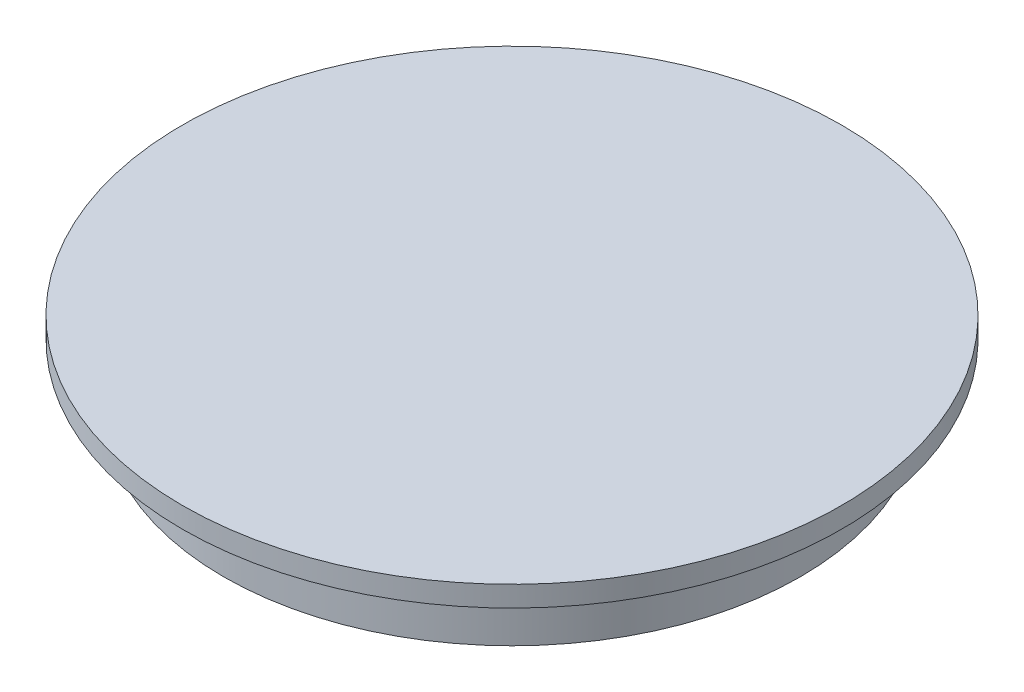
ISO-10303-21;
HEADER;
FILE_DESCRIPTION(('STEP AP214'),'2;1');
FILE_NAME('part.step','',(''),(''),'','','');
FILE_SCHEMA(('AUTOMOTIVE_DESIGN { 1 0 10303 214 1 1 1 1 }'));
ENDSEC;
DATA;
#1=APPLICATION_CONTEXT('core data for automotive mechanical design processes');
#2=APPLICATION_PROTOCOL_DEFINITION('international standard','automotive_design',2000,#1);
#3=PRODUCT_CONTEXT('',#1,'mechanical');
#4=PRODUCT('Part','Part','',(#3));
#5=PRODUCT_RELATED_PRODUCT_CATEGORY('part','',(#4));
#6=PRODUCT_DEFINITION_FORMATION('','',#4);
#7=PRODUCT_DEFINITION_CONTEXT('part definition',#1,'design');
#8=PRODUCT_DEFINITION('design','',#6,#7);
#9=PRODUCT_DEFINITION_SHAPE('','',#8);
#10=(LENGTH_UNIT() NAMED_UNIT(*) SI_UNIT(.MILLI.,.METRE.));
#11=(NAMED_UNIT(*) PLANE_ANGLE_UNIT() SI_UNIT($,.RADIAN.));
#12=(NAMED_UNIT(*) SI_UNIT($,.STERADIAN.) SOLID_ANGLE_UNIT());
#13=UNCERTAINTY_MEASURE_WITH_UNIT(LENGTH_MEASURE(1.E-05),#10,'distance_accuracy_value','');
#14=(GEOMETRIC_REPRESENTATION_CONTEXT(3) GLOBAL_UNCERTAINTY_ASSIGNED_CONTEXT((#13)) GLOBAL_UNIT_ASSIGNED_CONTEXT((#10,
#11,#12)) REPRESENTATION_CONTEXT('',''));
#15=CARTESIAN_POINT('',(0.,0.,0.));
#16=DIRECTION('',(0.,0.,1.));
#17=DIRECTION('',(1.,0.,0.));
#18=AXIS2_PLACEMENT_3D('',#15,#16,#17);
#19=CARTESIAN_POINT('',(0.,0.,0.));
#20=DIRECTION('',(0.,-1.,0.));
#21=DIRECTION('',(0.,0.,-1.));
#22=AXIS2_PLACEMENT_3D('',#19,#20,#21);
#23=PLANE('',#22);
#24=CARTESIAN_POINT('',(0.,0.,0.));
#25=DIRECTION('',(0.,-1.,0.));
#26=DIRECTION('',(0.,0.,-1.));
#27=AXIS2_PLACEMENT_3D('',#24,#25,#26);
#28=CIRCLE('',#27,50.8);
#29=CARTESIAN_POINT('',(0.,0.,-50.8));
#30=VERTEX_POINT('',#29);
#31=EDGE_CURVE('E10',#30,#30,#28,.T.);
#32=ORIENTED_EDGE('',*,*,#31,.F.);
#33=EDGE_LOOP('',(#32));
#34=FACE_BOUND('',#33,.T.);
#35=ADVANCED_FACE('F31',(#34),#23,.F.);
#36=CARTESIAN_POINT('',(0.,-12.7,0.));
#37=DIRECTION('',(0.,-1.,0.));
#38=DIRECTION('',(0.,0.,-1.));
#39=AXIS2_PLACEMENT_3D('',#36,#37,#38);
#40=CYLINDRICAL_SURFACE('',#39,50.8);
#41=CARTESIAN_POINT('',(0.,-3.17500000000001,0.));
#42=DIRECTION('',(0.,-1.,0.));
#43=DIRECTION('',(0.,0.,-1.));
#44=AXIS2_PLACEMENT_3D('',#41,#42,#43);
#45=CIRCLE('',#44,50.8);
#46=CARTESIAN_POINT('',(0.,-3.17500000000001,-50.8));
#47=VERTEX_POINT('',#46);
#48=EDGE_CURVE('E37',#47,#47,#45,.T.);
#49=ORIENTED_EDGE('',*,*,#48,.F.);
#50=EDGE_LOOP('',(#49));
#51=FACE_BOUND('',#50,.T.);
#52=ORIENTED_EDGE('',*,*,#31,.T.);
#53=EDGE_LOOP('',(#52));
#54=FACE_BOUND('',#53,.T.);
#55=ADVANCED_FACE('F75',(#51,#54),#40,.T.);
#56=CARTESIAN_POINT('',(-50.8,-3.17500000000001,0.));
#57=DIRECTION('',(0.,1.,0.));
#58=DIRECTION('',(0.,0.,1.));
#59=AXIS2_PLACEMENT_3D('',#56,#57,#58);
#60=PLANE('',#59);
#61=CARTESIAN_POINT('',(0.,-3.17500000000001,0.));
#62=DIRECTION('',(0.,-1.,0.));
#63=DIRECTION('',(0.,0.,-1.));
#64=AXIS2_PLACEMENT_3D('',#61,#62,#63);
#65=CIRCLE('',#64,44.45);
#66=CARTESIAN_POINT('',(0.,-3.17500000000001,-44.45));
#67=VERTEX_POINT('',#66);
#68=EDGE_CURVE('E41',#67,#67,#65,.T.);
#69=ORIENTED_EDGE('',*,*,#68,.F.);
#70=EDGE_LOOP('',(#69));
#71=FACE_BOUND('',#70,.T.);
#72=ORIENTED_EDGE('',*,*,#48,.T.);
#73=EDGE_LOOP('',(#72));
#74=FACE_BOUND('',#73,.T.);
#75=ADVANCED_FACE('F70',(#71,#74),#60,.F.);
#76=CARTESIAN_POINT('',(0.,-12.7,0.));
#77=DIRECTION('',(0.,-1.,0.));
#78=DIRECTION('',(0.,0.,-1.));
#79=AXIS2_PLACEMENT_3D('',#76,#77,#78);
#80=CYLINDRICAL_SURFACE('',#79,44.45);
#81=CARTESIAN_POINT('',(0.,-12.7,0.));
#82=DIRECTION('',(0.,-1.,0.));
#83=DIRECTION('',(0.,0.,-1.));
#84=AXIS2_PLACEMENT_3D('',#81,#82,#83);
#85=CIRCLE('',#84,44.45);
#86=CARTESIAN_POINT('',(0.,-12.7,-44.45));
#87=VERTEX_POINT('',#86);
#88=EDGE_CURVE('E45',#87,#87,#85,.T.);
#89=ORIENTED_EDGE('',*,*,#88,.F.);
#90=EDGE_LOOP('',(#89));
#91=FACE_BOUND('',#90,.T.);
#92=ORIENTED_EDGE('',*,*,#68,.T.);
#93=EDGE_LOOP('',(#92));
#94=FACE_BOUND('',#93,.T.);
#95=ADVANCED_FACE('F64',(#91,#94),#80,.T.);
#96=CARTESIAN_POINT('',(-44.45,-12.7,0.));
#97=DIRECTION('',(0.,1.,0.));
#98=DIRECTION('',(0.,0.,1.));
#99=AXIS2_PLACEMENT_3D('',#96,#97,#98);
#100=PLANE('',#99);
#101=CARTESIAN_POINT('',(0.,-12.7,0.));
#102=DIRECTION('',(0.,-1.,0.));
#103=DIRECTION('',(0.,0.,-1.));
#104=AXIS2_PLACEMENT_3D('',#101,#102,#103);
#105=CIRCLE('',#104,41.275);
#106=CARTESIAN_POINT('',(0.,-12.7,-41.275));
#107=VERTEX_POINT('',#106);
#108=EDGE_CURVE('E53',#107,#107,#105,.T.);
#109=ORIENTED_EDGE('',*,*,#108,.F.);
#110=EDGE_LOOP('',(#109));
#111=FACE_BOUND('',#110,.T.);
#112=ORIENTED_EDGE('',*,*,#88,.T.);
#113=EDGE_LOOP('',(#112));
#114=FACE_BOUND('',#113,.T.);
#115=ADVANCED_FACE('F60',(#111,#114),#100,.F.);
#116=CARTESIAN_POINT('',(-50.8,-3.17500000000001,0.));
#117=DIRECTION('',(0.,1.,0.));
#118=DIRECTION('',(0.,0.,1.));
#119=AXIS2_PLACEMENT_3D('',#116,#117,#118);
#120=PLANE('',#119);
#121=CARTESIAN_POINT('',(0.,-3.17500000000001,0.));
#122=DIRECTION('',(0.,1.,0.));
#123=DIRECTION('',(0.,0.,1.));
#124=AXIS2_PLACEMENT_3D('',#121,#122,#123);
#125=CIRCLE('',#124,41.275);
#126=CARTESIAN_POINT('',(0.,-3.17500000000001,41.275));
#127=VERTEX_POINT('',#126);
#128=EDGE_CURVE('E50',#127,#127,#125,.F.);
#129=ORIENTED_EDGE('',*,*,#128,.T.);
#130=EDGE_LOOP('',(#129));
#131=FACE_BOUND('',#130,.T.);
#132=ADVANCED_FACE('F63',(#131),#120,.F.);
#133=CARTESIAN_POINT('',(0.,113.568329573899,0.));
#134=DIRECTION('',(0.,-1.,0.));
#135=DIRECTION('',(0.,0.,-1.));
#136=AXIS2_PLACEMENT_3D('',#133,#134,#135);
#137=CYLINDRICAL_SURFACE('',#136,41.275);
#138=ORIENTED_EDGE('',*,*,#108,.T.);
#139=EDGE_LOOP('',(#138));
#140=FACE_BOUND('',#139,.T.);
#141=ORIENTED_EDGE('',*,*,#128,.F.);
#142=EDGE_LOOP('',(#141));
#143=FACE_BOUND('',#142,.T.);
#144=ADVANCED_FACE('F57',(#140,#143),#137,.F.);
#145=CLOSED_SHELL('',(#35,#55,#75,#95,#115,#132,#144));
#146=MANIFOLD_SOLID_BREP('B2',#145);
#147=ADVANCED_BREP_SHAPE_REPRESENTATION('',(#18,#146),#14);
#148=SHAPE_DEFINITION_REPRESENTATION(#9,#147);
ENDSEC;
END-ISO-10303-21;
